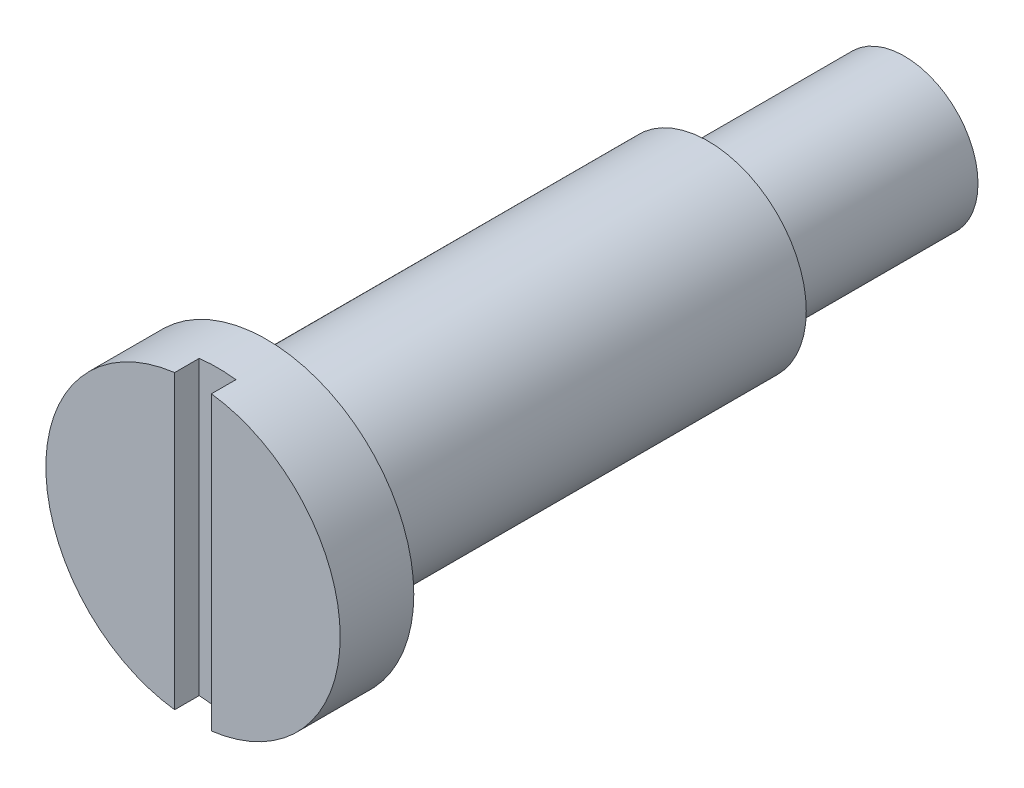
ISO-10303-21;
HEADER;
FILE_DESCRIPTION(('STEP AP214'),'2;1');
FILE_NAME('part.step','',(''),(''),'','','');
FILE_SCHEMA(('AUTOMOTIVE_DESIGN { 1 0 10303 214 1 1 1 1 }'));
ENDSEC;
DATA;
#1=APPLICATION_CONTEXT('core data for automotive mechanical design processes');
#2=APPLICATION_PROTOCOL_DEFINITION('international standard','automotive_design',2000,#1);
#3=PRODUCT_CONTEXT('',#1,'mechanical');
#4=PRODUCT('Part','Part','',(#3));
#5=PRODUCT_RELATED_PRODUCT_CATEGORY('part','',(#4));
#6=PRODUCT_DEFINITION_FORMATION('','',#4);
#7=PRODUCT_DEFINITION_CONTEXT('part definition',#1,'design');
#8=PRODUCT_DEFINITION('design','',#6,#7);
#9=PRODUCT_DEFINITION_SHAPE('','',#8);
#10=(LENGTH_UNIT() NAMED_UNIT(*) SI_UNIT(.MILLI.,.METRE.));
#11=(NAMED_UNIT(*) PLANE_ANGLE_UNIT() SI_UNIT($,.RADIAN.));
#12=(NAMED_UNIT(*) SI_UNIT($,.STERADIAN.) SOLID_ANGLE_UNIT());
#13=UNCERTAINTY_MEASURE_WITH_UNIT(LENGTH_MEASURE(1.E-05),#10,'distance_accuracy_value','');
#14=(GEOMETRIC_REPRESENTATION_CONTEXT(3) GLOBAL_UNCERTAINTY_ASSIGNED_CONTEXT((#13)) GLOBAL_UNIT_ASSIGNED_CONTEXT((#10,
#11,#12)) REPRESENTATION_CONTEXT('',''));
#15=CARTESIAN_POINT('',(0.,0.,0.));
#16=DIRECTION('',(0.,0.,1.));
#17=DIRECTION('',(1.,0.,0.));
#18=AXIS2_PLACEMENT_3D('',#15,#16,#17);
#19=CARTESIAN_POINT('',(0.,0.,0.));
#20=DIRECTION('',(0.,0.,-1.));
#21=DIRECTION('',(-1.,0.,0.));
#22=AXIS2_PLACEMENT_3D('',#19,#20,#21);
#23=PLANE('',#22);
#24=CARTESIAN_POINT('',(0.,0.,0.));
#25=DIRECTION('',(0.,0.,1.));
#26=DIRECTION('',(1.,0.,0.));
#27=AXIS2_PLACEMENT_3D('',#24,#25,#26);
#28=CIRCLE('',#27,6.);
#29=CARTESIAN_POINT('',(-0.75,5.95294044989533,0.));
#30=VERTEX_POINT('',#29);
#31=CARTESIAN_POINT('',(-0.749999999999998,-5.95294044989533,0.));
#32=VERTEX_POINT('',#31);
#33=EDGE_CURVE('E85',#30,#32,#28,.T.);
#34=ORIENTED_EDGE('',*,*,#33,.T.);
#35=DIRECTION('',(0.,-1.,0.));
#36=VECTOR('',#35,1.);
#37=CARTESIAN_POINT('',(-0.75,6.,0.));
#38=LINE('',#37,#36);
#39=EDGE_CURVE('E79',#30,#32,#38,.T.);
#40=ORIENTED_EDGE('',*,*,#39,.F.);
#41=EDGE_LOOP('',(#34,#40));
#42=FACE_BOUND('',#41,.T.);
#43=ADVANCED_FACE('F35',(#42),#23,.F.);
#44=CARTESIAN_POINT('',(0.750000000000001,-5.95294044989533,0.));
#45=VERTEX_POINT('',#44);
#46=CARTESIAN_POINT('',(0.75,5.95294044989533,0.));
#47=VERTEX_POINT('',#46);
#48=EDGE_CURVE('E91',#45,#47,#28,.T.);
#49=ORIENTED_EDGE('',*,*,#48,.T.);
#50=DIRECTION('',(0.,1.,0.));
#51=VECTOR('',#50,1.);
#52=CARTESIAN_POINT('',(0.75,6.,0.));
#53=LINE('',#52,#51);
#54=EDGE_CURVE('E86',#45,#47,#53,.T.);
#55=ORIENTED_EDGE('',*,*,#54,.F.);
#56=EDGE_LOOP('',(#49,#55));
#57=FACE_BOUND('',#56,.T.);
#58=ADVANCED_FACE('F37',(#57),#23,.F.);
#59=CARTESIAN_POINT('',(0.,0.,0.));
#60=DIRECTION('',(0.,0.,1.));
#61=DIRECTION('',(1.,0.,0.));
#62=AXIS2_PLACEMENT_3D('',#59,#60,#61);
#63=CYLINDRICAL_SURFACE('',#62,6.);
#64=ORIENTED_EDGE('',*,*,#33,.F.);
#65=DIRECTION('',(0.,0.,1.));
#66=VECTOR('',#65,1.);
#67=CARTESIAN_POINT('',(-0.75,5.95294044989533,0.));
#68=LINE('',#67,#66);
#69=CARTESIAN_POINT('',(-0.75,5.95294044989533,-1.));
#70=VERTEX_POINT('',#69);
#71=EDGE_CURVE('E11',#30,#70,#68,.F.);
#72=ORIENTED_EDGE('',*,*,#71,.T.);
#73=CARTESIAN_POINT('',(0.,0.,-1.));
#74=DIRECTION('',(0.,0.,1.));
#75=DIRECTION('',(1.,0.,0.));
#76=AXIS2_PLACEMENT_3D('',#73,#74,#75);
#77=CIRCLE('',#76,6.);
#78=CARTESIAN_POINT('',(0.75,5.95294044989533,-1.));
#79=VERTEX_POINT('',#78);
#80=EDGE_CURVE('E49',#79,#70,#77,.T.);
#81=ORIENTED_EDGE('',*,*,#80,.F.);
#82=DIRECTION('',(0.,0.,1.));
#83=VECTOR('',#82,1.);
#84=CARTESIAN_POINT('',(0.75,5.95294044989533,0.));
#85=LINE('',#84,#83);
#86=EDGE_CURVE('E43',#79,#47,#85,.T.);
#87=ORIENTED_EDGE('',*,*,#86,.T.);
#88=ORIENTED_EDGE('',*,*,#48,.F.);
#89=DIRECTION('',(0.,0.,1.));
#90=VECTOR('',#89,1.);
#91=CARTESIAN_POINT('',(0.750000000000002,-5.95294044989533,0.));
#92=LINE('',#91,#90);
#93=CARTESIAN_POINT('',(0.750000000000001,-5.95294044989533,-1.));
#94=VERTEX_POINT('',#93);
#95=EDGE_CURVE('E93',#45,#94,#92,.F.);
#96=ORIENTED_EDGE('',*,*,#95,.T.);
#97=CARTESIAN_POINT('',(-0.749999999999998,-5.95294044989533,-1.));
#98=VERTEX_POINT('',#97);
#99=EDGE_CURVE('E57',#98,#94,#77,.T.);
#100=ORIENTED_EDGE('',*,*,#99,.F.);
#101=DIRECTION('',(0.,0.,1.));
#102=VECTOR('',#101,1.);
#103=CARTESIAN_POINT('',(-0.749999999999998,-5.95294044989533,0.));
#104=LINE('',#103,#102);
#105=EDGE_CURVE('E90',#98,#32,#104,.T.);
#106=ORIENTED_EDGE('',*,*,#105,.T.);
#107=EDGE_LOOP('',(#64,#72,#81,#87,#88,#96,#100,#106));
#108=FACE_BOUND('',#107,.T.);
#109=CARTESIAN_POINT('',(0.,0.,-3.));
#110=DIRECTION('',(0.,0.,1.));
#111=DIRECTION('',(1.,0.,0.));
#112=AXIS2_PLACEMENT_3D('',#109,#110,#111);
#113=CIRCLE('',#112,6.);
#114=CARTESIAN_POINT('',(6.,0.,-3.));
#115=VERTEX_POINT('',#114);
#116=EDGE_CURVE('E96',#115,#115,#113,.T.);
#117=ORIENTED_EDGE('',*,*,#116,.T.);
#118=EDGE_LOOP('',(#117));
#119=FACE_BOUND('',#118,.T.);
#120=ADVANCED_FACE('F88',(#108,#119),#63,.T.);
#121=CARTESIAN_POINT('',(0.,6.,-3.));
#122=DIRECTION('',(0.,0.,1.));
#123=DIRECTION('',(1.,0.,0.));
#124=AXIS2_PLACEMENT_3D('',#121,#122,#123);
#125=PLANE('',#124);
#126=ORIENTED_EDGE('',*,*,#116,.F.);
#127=EDGE_LOOP('',(#126));
#128=FACE_BOUND('',#127,.T.);
#129=CARTESIAN_POINT('',(0.,0.,-3.));
#130=DIRECTION('',(0.,0.,1.));
#131=DIRECTION('',(1.,0.,0.));
#132=AXIS2_PLACEMENT_3D('',#129,#130,#131);
#133=CIRCLE('',#132,4.);
#134=CARTESIAN_POINT('',(4.,0.,-3.));
#135=VERTEX_POINT('',#134);
#136=EDGE_CURVE('E118',#135,#135,#133,.T.);
#137=ORIENTED_EDGE('',*,*,#136,.T.);
#138=EDGE_LOOP('',(#137));
#139=FACE_BOUND('',#138,.T.);
#140=ADVANCED_FACE('F125',(#128,#139),#125,.F.);
#141=CARTESIAN_POINT('',(0.,0.,0.));
#142=DIRECTION('',(0.,0.,1.));
#143=DIRECTION('',(1.,0.,0.));
#144=AXIS2_PLACEMENT_3D('',#141,#142,#143);
#145=CYLINDRICAL_SURFACE('',#144,4.);
#146=ORIENTED_EDGE('',*,*,#136,.F.);
#147=EDGE_LOOP('',(#146));
#148=FACE_BOUND('',#147,.T.);
#149=CARTESIAN_POINT('',(0.,0.,-21.));
#150=DIRECTION('',(0.,0.,1.));
#151=DIRECTION('',(1.,0.,0.));
#152=AXIS2_PLACEMENT_3D('',#149,#150,#151);
#153=CIRCLE('',#152,4.);
#154=CARTESIAN_POINT('',(4.,0.,-21.));
#155=VERTEX_POINT('',#154);
#156=EDGE_CURVE('E116',#155,#155,#153,.T.);
#157=ORIENTED_EDGE('',*,*,#156,.T.);
#158=EDGE_LOOP('',(#157));
#159=FACE_BOUND('',#158,.T.);
#160=ADVANCED_FACE('F127',(#148,#159),#145,.T.);
#161=CARTESIAN_POINT('',(0.,4.,-21.));
#162=DIRECTION('',(0.,0.,1.));
#163=DIRECTION('',(1.,0.,0.));
#164=AXIS2_PLACEMENT_3D('',#161,#162,#163);
#165=PLANE('',#164);
#166=ORIENTED_EDGE('',*,*,#156,.F.);
#167=EDGE_LOOP('',(#166));
#168=FACE_BOUND('',#167,.T.);
#169=CARTESIAN_POINT('',(0.,0.,-21.));
#170=DIRECTION('',(0.,0.,1.));
#171=DIRECTION('',(1.,0.,0.));
#172=AXIS2_PLACEMENT_3D('',#169,#170,#171);
#173=CIRCLE('',#172,3.);
#174=CARTESIAN_POINT('',(3.,0.,-21.));
#175=VERTEX_POINT('',#174);
#176=EDGE_CURVE('E109',#175,#175,#173,.T.);
#177=ORIENTED_EDGE('',*,*,#176,.T.);
#178=EDGE_LOOP('',(#177));
#179=FACE_BOUND('',#178,.T.);
#180=ADVANCED_FACE('F133',(#168,#179),#165,.F.);
#181=CARTESIAN_POINT('',(0.,0.,0.));
#182=DIRECTION('',(0.,0.,1.));
#183=DIRECTION('',(1.,0.,0.));
#184=AXIS2_PLACEMENT_3D('',#181,#182,#183);
#185=CYLINDRICAL_SURFACE('',#184,3.);
#186=ORIENTED_EDGE('',*,*,#176,.F.);
#187=EDGE_LOOP('',(#186));
#188=FACE_BOUND('',#187,.T.);
#189=CARTESIAN_POINT('',(0.,0.,-29.));
#190=DIRECTION('',(0.,0.,1.));
#191=DIRECTION('',(1.,0.,0.));
#192=AXIS2_PLACEMENT_3D('',#189,#190,#191);
#193=CIRCLE('',#192,3.);
#194=CARTESIAN_POINT('',(3.,0.,-29.));
#195=VERTEX_POINT('',#194);
#196=EDGE_CURVE('E106',#195,#195,#193,.T.);
#197=ORIENTED_EDGE('',*,*,#196,.T.);
#198=EDGE_LOOP('',(#197));
#199=FACE_BOUND('',#198,.T.);
#200=ADVANCED_FACE('F157',(#188,#199),#185,.T.);
#201=CARTESIAN_POINT('',(0.,3.,-29.));
#202=DIRECTION('',(0.,0.,1.));
#203=DIRECTION('',(1.,0.,0.));
#204=AXIS2_PLACEMENT_3D('',#201,#202,#203);
#205=PLANE('',#204);
#206=ORIENTED_EDGE('',*,*,#196,.F.);
#207=EDGE_LOOP('',(#206));
#208=FACE_BOUND('',#207,.T.);
#209=ADVANCED_FACE('F152',(#208),#205,.F.);
#210=CARTESIAN_POINT('',(-0.75,6.,-1.));
#211=DIRECTION('',(-1.,0.,0.));
#212=DIRECTION('',(0.,-1.,0.));
#213=AXIS2_PLACEMENT_3D('',#210,#211,#212);
#214=PLANE('',#213);
#215=DIRECTION('',(0.,-1.,0.));
#216=VECTOR('',#215,1.);
#217=CARTESIAN_POINT('',(-0.75,6.,-1.));
#218=LINE('',#217,#216);
#219=EDGE_CURVE('E81',#70,#98,#218,.T.);
#220=ORIENTED_EDGE('',*,*,#219,.F.);
#221=ORIENTED_EDGE('',*,*,#71,.F.);
#222=ORIENTED_EDGE('',*,*,#39,.T.);
#223=ORIENTED_EDGE('',*,*,#105,.F.);
#224=EDGE_LOOP('',(#220,#221,#222,#223));
#225=FACE_BOUND('',#224,.T.);
#226=ADVANCED_FACE('F77',(#225),#214,.F.);
#227=CARTESIAN_POINT('',(0.75,6.,-1.));
#228=DIRECTION('',(1.,0.,0.));
#229=DIRECTION('',(0.,1.,0.));
#230=AXIS2_PLACEMENT_3D('',#227,#228,#229);
#231=PLANE('',#230);
#232=DIRECTION('',(0.,1.,0.));
#233=VECTOR('',#232,1.);
#234=CARTESIAN_POINT('',(0.75,6.,-1.));
#235=LINE('',#234,#233);
#236=EDGE_CURVE('E104',#94,#79,#235,.T.);
#237=ORIENTED_EDGE('',*,*,#236,.F.);
#238=ORIENTED_EDGE('',*,*,#95,.F.);
#239=ORIENTED_EDGE('',*,*,#54,.T.);
#240=ORIENTED_EDGE('',*,*,#86,.F.);
#241=EDGE_LOOP('',(#237,#238,#239,#240));
#242=FACE_BOUND('',#241,.T.);
#243=ADVANCED_FACE('F144',(#242),#231,.F.);
#244=CARTESIAN_POINT('',(0.,0.,-1.));
#245=DIRECTION('',(0.,0.,1.));
#246=DIRECTION('',(1.,0.,0.));
#247=AXIS2_PLACEMENT_3D('',#244,#245,#246);
#248=PLANE('',#247);
#249=ORIENTED_EDGE('',*,*,#236,.T.);
#250=ORIENTED_EDGE('',*,*,#80,.T.);
#251=ORIENTED_EDGE('',*,*,#219,.T.);
#252=ORIENTED_EDGE('',*,*,#99,.T.);
#253=EDGE_LOOP('',(#249,#250,#251,#252));
#254=FACE_BOUND('',#253,.T.);
#255=ADVANCED_FACE('F103',(#254),#248,.T.);
#256=CLOSED_SHELL('',(#43,#58,#120,#140,#160,#180,#200,#209,#226,#243,#255));
#257=MANIFOLD_SOLID_BREP('B2',#256);
#258=ADVANCED_BREP_SHAPE_REPRESENTATION('',(#18,#257),#14);
#259=SHAPE_DEFINITION_REPRESENTATION(#9,#258);
ENDSEC;
END-ISO-10303-21;
